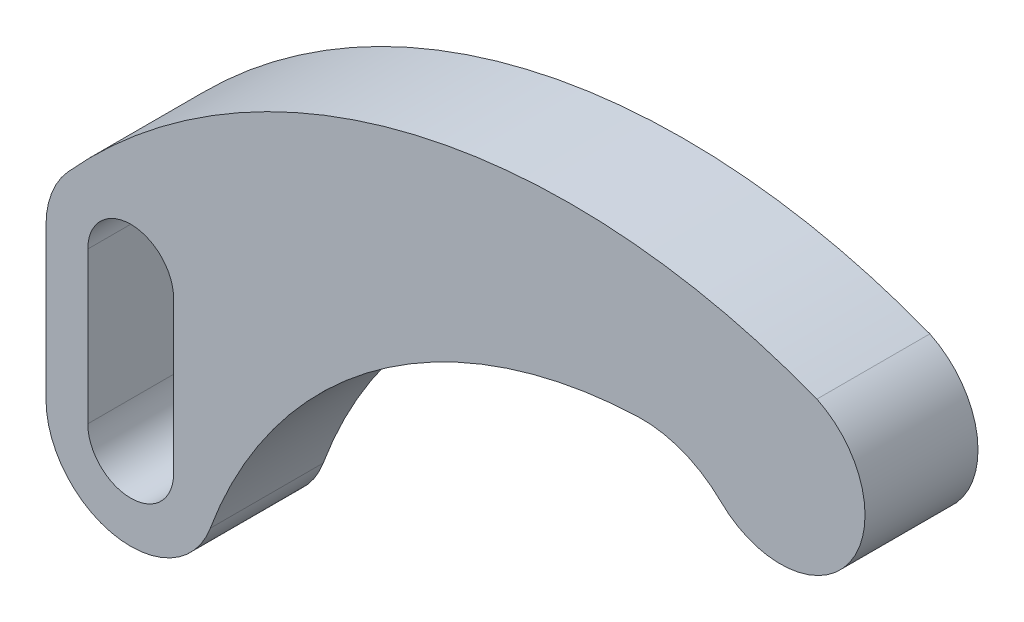
ISO-10303-21;
HEADER;
FILE_DESCRIPTION(('STEP AP214'),'2;1');
FILE_NAME('part.step','',(''),(''),'','','');
FILE_SCHEMA(('AUTOMOTIVE_DESIGN { 1 0 10303 214 1 1 1 1 }'));
ENDSEC;
DATA;
#1=APPLICATION_CONTEXT('core data for automotive mechanical design processes');
#2=APPLICATION_PROTOCOL_DEFINITION('international standard','automotive_design',2000,#1);
#3=PRODUCT_CONTEXT('',#1,'mechanical');
#4=PRODUCT('Part','Part','',(#3));
#5=PRODUCT_RELATED_PRODUCT_CATEGORY('part','',(#4));
#6=PRODUCT_DEFINITION_FORMATION('','',#4);
#7=PRODUCT_DEFINITION_CONTEXT('part definition',#1,'design');
#8=PRODUCT_DEFINITION('design','',#6,#7);
#9=PRODUCT_DEFINITION_SHAPE('','',#8);
#10=(LENGTH_UNIT() NAMED_UNIT(*) SI_UNIT(.MILLI.,.METRE.));
#11=(NAMED_UNIT(*) PLANE_ANGLE_UNIT() SI_UNIT($,.RADIAN.));
#12=(NAMED_UNIT(*) SI_UNIT($,.STERADIAN.) SOLID_ANGLE_UNIT());
#13=UNCERTAINTY_MEASURE_WITH_UNIT(LENGTH_MEASURE(1.E-05),#10,'distance_accuracy_value','');
#14=(GEOMETRIC_REPRESENTATION_CONTEXT(3) GLOBAL_UNCERTAINTY_ASSIGNED_CONTEXT((#13)) GLOBAL_UNIT_ASSIGNED_CONTEXT((#10,
#11,#12)) REPRESENTATION_CONTEXT('',''));
#15=CARTESIAN_POINT('',(0.,0.,0.));
#16=DIRECTION('',(0.,0.,1.));
#17=DIRECTION('',(1.,0.,0.));
#18=AXIS2_PLACEMENT_3D('',#15,#16,#17);
#19=CARTESIAN_POINT('',(-138.292145666748,-40.4654224943898,25.4));
#20=DIRECTION('',(0.,0.,-1.));
#21=DIRECTION('',(-1.,0.,0.));
#22=AXIS2_PLACEMENT_3D('',#19,#20,#21);
#23=CYLINDRICAL_SURFACE('',#22,9.65200000000001);
#24=CARTESIAN_POINT('',(-138.292145666748,-40.4654224943898,0.));
#25=DIRECTION('',(0.,0.,1.));
#26=DIRECTION('',(1.,0.,0.));
#27=AXIS2_PLACEMENT_3D('',#24,#25,#26);
#28=CIRCLE('',#27,9.65200000000001);
#29=CARTESIAN_POINT('',(-147.944145666748,-40.4654224943898,0.));
#30=VERTEX_POINT('',#29);
#31=CARTESIAN_POINT('',(-128.640145666748,-40.4654224943898,0.));
#32=VERTEX_POINT('',#31);
#33=EDGE_CURVE('E184',#30,#32,#28,.T.);
#34=ORIENTED_EDGE('',*,*,#33,.F.);
#35=DIRECTION('',(0.,0.,-1.));
#36=VECTOR('',#35,1.);
#37=CARTESIAN_POINT('',(-147.944145666748,-40.4654224943898,25.4));
#38=LINE('',#37,#36);
#39=CARTESIAN_POINT('',(-147.944145666748,-40.4654224943898,25.4));
#40=VERTEX_POINT('',#39);
#41=EDGE_CURVE('E11',#40,#30,#38,.T.);
#42=ORIENTED_EDGE('',*,*,#41,.F.);
#43=CARTESIAN_POINT('',(-138.292145666748,-40.4654224943898,25.4));
#44=DIRECTION('',(0.,0.,1.));
#45=DIRECTION('',(1.,0.,0.));
#46=AXIS2_PLACEMENT_3D('',#43,#44,#45);
#47=CIRCLE('',#46,9.65200000000001);
#48=CARTESIAN_POINT('',(-128.640145666748,-40.4654224943898,25.4));
#49=VERTEX_POINT('',#48);
#50=EDGE_CURVE('E147',#40,#49,#47,.T.);
#51=ORIENTED_EDGE('',*,*,#50,.T.);
#52=DIRECTION('',(0.,0.,-1.));
#53=VECTOR('',#52,1.);
#54=CARTESIAN_POINT('',(-128.640145666748,-40.4654224943898,25.4));
#55=LINE('',#54,#53);
#56=EDGE_CURVE('E102',#49,#32,#55,.T.);
#57=ORIENTED_EDGE('',*,*,#56,.T.);
#58=EDGE_LOOP('',(#34,#42,#51,#57));
#59=FACE_BOUND('',#58,.T.);
#60=ADVANCED_FACE('F39',(#59),#23,.F.);
#61=CARTESIAN_POINT('',(-147.944145666748,0.,25.4));
#62=DIRECTION('',(1.,0.,0.));
#63=DIRECTION('',(0.,0.,-1.));
#64=AXIS2_PLACEMENT_3D('',#61,#62,#63);
#65=PLANE('',#64);
#66=DIRECTION('',(0.,-1.,0.));
#67=VECTOR('',#66,1.);
#68=CARTESIAN_POINT('',(-147.944145666748,0.,0.));
#69=LINE('',#68,#67);
#70=CARTESIAN_POINT('',(-147.944145666748,-6.42942249438982,0.));
#71=VERTEX_POINT('',#70);
#72=EDGE_CURVE('E138',#71,#30,#69,.T.);
#73=ORIENTED_EDGE('',*,*,#72,.F.);
#74=DIRECTION('',(0.,0.,-1.));
#75=VECTOR('',#74,1.);
#76=CARTESIAN_POINT('',(-147.944145666748,-6.42942249438982,25.4));
#77=LINE('',#76,#75);
#78=CARTESIAN_POINT('',(-147.944145666748,-6.42942249438982,25.4));
#79=VERTEX_POINT('',#78);
#80=EDGE_CURVE('E50',#79,#71,#77,.T.);
#81=ORIENTED_EDGE('',*,*,#80,.F.);
#82=DIRECTION('',(0.,-1.,0.));
#83=VECTOR('',#82,1.);
#84=CARTESIAN_POINT('',(-147.944145666748,0.,25.4));
#85=LINE('',#84,#83);
#86=EDGE_CURVE('E136',#79,#40,#85,.T.);
#87=ORIENTED_EDGE('',*,*,#86,.T.);
#88=ORIENTED_EDGE('',*,*,#41,.T.);
#89=EDGE_LOOP('',(#73,#81,#87,#88));
#90=FACE_BOUND('',#89,.T.);
#91=ADVANCED_FACE('F135',(#90),#65,.T.);
#92=CARTESIAN_POINT('',(-138.292145666748,-6.42942249438982,25.4));
#93=DIRECTION('',(0.,0.,-1.));
#94=DIRECTION('',(-1.,0.,0.));
#95=AXIS2_PLACEMENT_3D('',#92,#93,#94);
#96=CYLINDRICAL_SURFACE('',#95,9.65200000000001);
#97=CARTESIAN_POINT('',(-138.292145666748,-6.42942249438982,0.));
#98=DIRECTION('',(0.,0.,1.));
#99=DIRECTION('',(1.,0.,0.));
#100=AXIS2_PLACEMENT_3D('',#97,#98,#99);
#101=CIRCLE('',#100,9.65200000000001);
#102=CARTESIAN_POINT('',(-128.640145666748,-6.42942249438982,0.));
#103=VERTEX_POINT('',#102);
#104=EDGE_CURVE('E190',#103,#71,#101,.T.);
#105=ORIENTED_EDGE('',*,*,#104,.F.);
#106=DIRECTION('',(0.,0.,-1.));
#107=VECTOR('',#106,1.);
#108=CARTESIAN_POINT('',(-128.640145666748,-6.42942249438982,25.4));
#109=LINE('',#108,#107);
#110=CARTESIAN_POINT('',(-128.640145666748,-6.42942249438982,25.4));
#111=VERTEX_POINT('',#110);
#112=EDGE_CURVE('E95',#111,#103,#109,.T.);
#113=ORIENTED_EDGE('',*,*,#112,.F.);
#114=CARTESIAN_POINT('',(-138.292145666748,-6.42942249438982,25.4));
#115=DIRECTION('',(0.,0.,1.));
#116=DIRECTION('',(1.,0.,0.));
#117=AXIS2_PLACEMENT_3D('',#114,#115,#116);
#118=CIRCLE('',#117,9.65200000000001);
#119=EDGE_CURVE('E146',#111,#79,#118,.T.);
#120=ORIENTED_EDGE('',*,*,#119,.T.);
#121=ORIENTED_EDGE('',*,*,#80,.T.);
#122=EDGE_LOOP('',(#105,#113,#120,#121));
#123=FACE_BOUND('',#122,.T.);
#124=ADVANCED_FACE('F150',(#123),#96,.F.);
#125=CARTESIAN_POINT('',(-20.2813273562544,-83.8414488417584,25.4));
#126=DIRECTION('',(0.,0.,-1.));
#127=DIRECTION('',(-1.,0.,0.));
#128=AXIS2_PLACEMENT_3D('',#125,#126,#127);
#129=CYLINDRICAL_SURFACE('',#128,106.68);
#130=CARTESIAN_POINT('',(-20.2813273562544,-83.8414488417584,0.));
#131=DIRECTION('',(0.,0.,1.));
#132=DIRECTION('',(1.,0.,0.));
#133=AXIS2_PLACEMENT_3D('',#130,#131,#132);
#134=CIRCLE('',#133,106.68);
#135=CARTESIAN_POINT('',(-24.3098335387946,22.7624607391629,0.));
#136=VERTEX_POINT('',#135);
#137=CARTESIAN_POINT('',(-120.411718650007,-47.0375476985366,0.));
#138=VERTEX_POINT('',#137);
#139=EDGE_CURVE('E158',#136,#138,#134,.T.);
#140=ORIENTED_EDGE('',*,*,#139,.F.);
#141=DIRECTION('',(0.,0.,-1.));
#142=VECTOR('',#141,1.);
#143=CARTESIAN_POINT('',(-24.3098335387946,22.7624607391629,25.4));
#144=LINE('',#143,#142);
#145=CARTESIAN_POINT('',(-24.3098335387946,22.7624607391629,25.4));
#146=VERTEX_POINT('',#145);
#147=EDGE_CURVE('E43',#146,#136,#144,.T.);
#148=ORIENTED_EDGE('',*,*,#147,.F.);
#149=CARTESIAN_POINT('',(-20.2813273562544,-83.8414488417584,25.4));
#150=DIRECTION('',(0.,0.,1.));
#151=DIRECTION('',(1.,0.,0.));
#152=AXIS2_PLACEMENT_3D('',#149,#150,#151);
#153=CIRCLE('',#152,106.68);
#154=CARTESIAN_POINT('',(-120.411718650007,-47.0375476985366,25.4));
#155=VERTEX_POINT('',#154);
#156=EDGE_CURVE('E196',#146,#155,#153,.T.);
#157=ORIENTED_EDGE('',*,*,#156,.T.);
#158=DIRECTION('',(0.,0.,-1.));
#159=VECTOR('',#158,1.);
#160=CARTESIAN_POINT('',(-120.411718650007,-47.0375476985366,25.4));
#161=LINE('',#160,#159);
#162=EDGE_CURVE('E154',#155,#138,#161,.T.);
#163=ORIENTED_EDGE('',*,*,#162,.T.);
#164=EDGE_LOOP('',(#140,#148,#157,#163));
#165=FACE_BOUND('',#164,.T.);
#166=ADVANCED_FACE('F41',(#165),#129,.F.);
#167=CARTESIAN_POINT('',(-23.3506654000946,-2.61942249438982,25.4));
#168=DIRECTION('',(0.,0.,-1.));
#169=DIRECTION('',(-1.,0.,0.));
#170=AXIS2_PLACEMENT_3D('',#167,#168,#169);
#171=CYLINDRICAL_SURFACE('',#170,25.4);
#172=CARTESIAN_POINT('',(-23.3506654000946,-2.61942249438982,0.));
#173=DIRECTION('',(0.,0.,1.));
#174=DIRECTION('',(1.,0.,0.));
#175=AXIS2_PLACEMENT_3D('',#172,#173,#174);
#176=CIRCLE('',#175,25.4);
#177=CARTESIAN_POINT('',(-5.57436840961095,15.5234346484673,0.));
#178=VERTEX_POINT('',#177);
#179=EDGE_CURVE('E162',#178,#136,#176,.T.);
#180=ORIENTED_EDGE('',*,*,#179,.F.);
#181=DIRECTION('',(0.,0.,-1.));
#182=VECTOR('',#181,1.);
#183=CARTESIAN_POINT('',(-5.57436840961095,15.5234346484673,25.4));
#184=LINE('',#183,#182);
#185=CARTESIAN_POINT('',(-5.57436840961095,15.5234346484673,25.4));
#186=VERTEX_POINT('',#185);
#187=EDGE_CURVE('E216',#186,#178,#184,.T.);
#188=ORIENTED_EDGE('',*,*,#187,.F.);
#189=CARTESIAN_POINT('',(-23.3506654000946,-2.61942249438982,25.4));
#190=DIRECTION('',(0.,0.,1.));
#191=DIRECTION('',(1.,0.,0.));
#192=AXIS2_PLACEMENT_3D('',#189,#190,#191);
#193=CIRCLE('',#192,25.4);
#194=EDGE_CURVE('E227',#186,#146,#193,.T.);
#195=ORIENTED_EDGE('',*,*,#194,.T.);
#196=ORIENTED_EDGE('',*,*,#147,.T.);
#197=EDGE_LOOP('',(#180,#188,#195,#196));
#198=FACE_BOUND('',#197,.T.);
#199=ADVANCED_FACE('F225',(#198),#171,.F.);
#200=CARTESIAN_POINT('',(7.75785433325176,29.1305775056102,25.4));
#201=DIRECTION('',(0.,0.,-1.));
#202=DIRECTION('',(-1.,0.,0.));
#203=AXIS2_PLACEMENT_3D('',#200,#201,#202);
#204=CYLINDRICAL_SURFACE('',#203,19.05);
#205=CARTESIAN_POINT('',(7.75785433325176,29.1305775056102,0.));
#206=DIRECTION('',(0.,0.,1.));
#207=DIRECTION('',(1.,0.,0.));
#208=AXIS2_PLACEMENT_3D('',#205,#206,#207);
#209=CIRCLE('',#208,19.05);
#210=CARTESIAN_POINT('',(15.981707982364,46.3140210242412,0.));
#211=VERTEX_POINT('',#210);
#212=EDGE_CURVE('E166',#178,#211,#209,.T.);
#213=ORIENTED_EDGE('',*,*,#212,.T.);
#214=DIRECTION('',(0.,0.,-1.));
#215=VECTOR('',#214,1.);
#216=CARTESIAN_POINT('',(15.981707982364,46.3140210242412,25.4));
#217=LINE('',#216,#215);
#218=CARTESIAN_POINT('',(15.981707982364,46.3140210242412,25.4));
#219=VERTEX_POINT('',#218);
#220=EDGE_CURVE('E213',#219,#211,#217,.T.);
#221=ORIENTED_EDGE('',*,*,#220,.F.);
#222=CARTESIAN_POINT('',(7.75785433325176,29.1305775056102,25.4));
#223=DIRECTION('',(0.,0.,1.));
#224=DIRECTION('',(1.,0.,0.));
#225=AXIS2_PLACEMENT_3D('',#222,#223,#224);
#226=CIRCLE('',#225,19.05);
#227=EDGE_CURVE('E246',#186,#219,#226,.T.);
#228=ORIENTED_EDGE('',*,*,#227,.F.);
#229=ORIENTED_EDGE('',*,*,#187,.T.);
#230=EDGE_LOOP('',(#213,#221,#228,#229));
#231=FACE_BOUND('',#230,.T.);
#232=ADVANCED_FACE('F236',(#231),#204,.T.);
#233=CARTESIAN_POINT('',(-39.2533981981608,-95.7241535811308,25.4));
#234=DIRECTION('',(0.,0.,-1.));
#235=DIRECTION('',(-1.,0.,0.));
#236=AXIS2_PLACEMENT_3D('',#233,#234,#235);
#237=CYLINDRICAL_SURFACE('',#236,152.4);
#238=CARTESIAN_POINT('',(-39.2533981981608,-95.7241535811308,0.));
#239=DIRECTION('',(0.,0.,1.));
#240=DIRECTION('',(1.,0.,0.));
#241=AXIS2_PLACEMENT_3D('',#238,#239,#240);
#242=CIRCLE('',#241,152.4);
#243=CARTESIAN_POINT('',(-152.440538162261,6.32696766085889,0.));
#244=VERTEX_POINT('',#243);
#245=EDGE_CURVE('E169',#211,#244,#242,.T.);
#246=ORIENTED_EDGE('',*,*,#245,.T.);
#247=DIRECTION('',(0.,0.,-1.));
#248=VECTOR('',#247,1.);
#249=CARTESIAN_POINT('',(-152.440538162261,6.32696766085889,25.4));
#250=LINE('',#249,#248);
#251=CARTESIAN_POINT('',(-152.440538162261,6.32696766085889,25.4));
#252=VERTEX_POINT('',#251);
#253=EDGE_CURVE('E209',#252,#244,#250,.T.);
#254=ORIENTED_EDGE('',*,*,#253,.F.);
#255=CARTESIAN_POINT('',(-39.2533981981608,-95.7241535811308,25.4));
#256=DIRECTION('',(0.,0.,1.));
#257=DIRECTION('',(1.,0.,0.));
#258=AXIS2_PLACEMENT_3D('',#255,#256,#257);
#259=CIRCLE('',#258,152.4);
#260=EDGE_CURVE('E241',#219,#252,#259,.T.);
#261=ORIENTED_EDGE('',*,*,#260,.F.);
#262=ORIENTED_EDGE('',*,*,#220,.T.);
#263=EDGE_LOOP('',(#246,#254,#261,#262));
#264=FACE_BOUND('',#263,.T.);
#265=ADVANCED_FACE('F239',(#264),#237,.T.);
#266=CARTESIAN_POINT('',(-138.292145666748,-6.42942249438982,25.4));
#267=DIRECTION('',(0.,0.,-1.));
#268=DIRECTION('',(-1.,0.,0.));
#269=AXIS2_PLACEMENT_3D('',#266,#267,#268);
#270=CYLINDRICAL_SURFACE('',#269,19.05);
#271=CARTESIAN_POINT('',(-138.292145666748,-6.42942249438982,0.));
#272=DIRECTION('',(0.,0.,1.));
#273=DIRECTION('',(1.,0.,0.));
#274=AXIS2_PLACEMENT_3D('',#271,#272,#273);
#275=CIRCLE('',#274,19.05);
#276=CARTESIAN_POINT('',(-157.342145666748,-6.42942249438982,0.));
#277=VERTEX_POINT('',#276);
#278=EDGE_CURVE('E172',#244,#277,#275,.T.);
#279=ORIENTED_EDGE('',*,*,#278,.T.);
#280=DIRECTION('',(0.,0.,-1.));
#281=VECTOR('',#280,1.);
#282=CARTESIAN_POINT('',(-157.342145666748,-6.42942249438982,25.4));
#283=LINE('',#282,#281);
#284=CARTESIAN_POINT('',(-157.342145666748,-6.42942249438982,25.4));
#285=VERTEX_POINT('',#284);
#286=EDGE_CURVE('E206',#285,#277,#283,.T.);
#287=ORIENTED_EDGE('',*,*,#286,.F.);
#288=CARTESIAN_POINT('',(-138.292145666748,-6.42942249438982,25.4));
#289=DIRECTION('',(0.,0.,1.));
#290=DIRECTION('',(1.,0.,0.));
#291=AXIS2_PLACEMENT_3D('',#288,#289,#290);
#292=CIRCLE('',#291,19.05);
#293=EDGE_CURVE('E245',#252,#285,#292,.T.);
#294=ORIENTED_EDGE('',*,*,#293,.F.);
#295=ORIENTED_EDGE('',*,*,#253,.T.);
#296=EDGE_LOOP('',(#279,#287,#294,#295));
#297=FACE_BOUND('',#296,.T.);
#298=ADVANCED_FACE('F284',(#297),#270,.T.);
#299=CARTESIAN_POINT('',(-157.342145666748,-2.56617805945395E-13,25.4));
#300=DIRECTION('',(-1.,0.,0.));
#301=DIRECTION('',(0.,-1.,0.));
#302=AXIS2_PLACEMENT_3D('',#299,#300,#301);
#303=PLANE('',#302);
#304=DIRECTION('',(0.,1.,0.));
#305=VECTOR('',#304,1.);
#306=CARTESIAN_POINT('',(-157.342145666748,-2.56617805945395E-13,0.));
#307=LINE('',#306,#305);
#308=CARTESIAN_POINT('',(-157.342145666748,-40.4654224943898,0.));
#309=VERTEX_POINT('',#308);
#310=EDGE_CURVE('E176',#309,#277,#307,.T.);
#311=ORIENTED_EDGE('',*,*,#310,.F.);
#312=DIRECTION('',(0.,0.,-1.));
#313=VECTOR('',#312,1.);
#314=CARTESIAN_POINT('',(-157.342145666748,-40.4654224943898,25.4));
#315=LINE('',#314,#313);
#316=CARTESIAN_POINT('',(-157.342145666748,-40.4654224943898,25.4));
#317=VERTEX_POINT('',#316);
#318=EDGE_CURVE('E203',#317,#309,#315,.T.);
#319=ORIENTED_EDGE('',*,*,#318,.F.);
#320=DIRECTION('',(0.,1.,0.));
#321=VECTOR('',#320,1.);
#322=CARTESIAN_POINT('',(-157.342145666748,-2.56617805945395E-13,25.4));
#323=LINE('',#322,#321);
#324=EDGE_CURVE('E250',#317,#285,#323,.T.);
#325=ORIENTED_EDGE('',*,*,#324,.T.);
#326=ORIENTED_EDGE('',*,*,#286,.T.);
#327=EDGE_LOOP('',(#311,#319,#325,#326));
#328=FACE_BOUND('',#327,.T.);
#329=ADVANCED_FACE('F270',(#328),#303,.T.);
#330=CARTESIAN_POINT('',(-138.292145666748,-40.4654224943898,25.4));
#331=DIRECTION('',(0.,0.,-1.));
#332=DIRECTION('',(-1.,0.,0.));
#333=AXIS2_PLACEMENT_3D('',#330,#331,#332);
#334=CYLINDRICAL_SURFACE('',#333,19.05);
#335=CARTESIAN_POINT('',(-138.292145666748,-40.4654224943898,0.));
#336=DIRECTION('',(0.,0.,1.));
#337=DIRECTION('',(1.,0.,0.));
#338=AXIS2_PLACEMENT_3D('',#335,#336,#337);
#339=CIRCLE('',#338,19.05);
#340=EDGE_CURVE('E180',#309,#138,#339,.T.);
#341=ORIENTED_EDGE('',*,*,#340,.T.);
#342=ORIENTED_EDGE('',*,*,#162,.F.);
#343=CARTESIAN_POINT('',(-138.292145666748,-40.4654224943898,25.4));
#344=DIRECTION('',(0.,0.,1.));
#345=DIRECTION('',(1.,0.,0.));
#346=AXIS2_PLACEMENT_3D('',#343,#344,#345);
#347=CIRCLE('',#346,19.05);
#348=EDGE_CURVE('E258',#317,#155,#347,.T.);
#349=ORIENTED_EDGE('',*,*,#348,.F.);
#350=ORIENTED_EDGE('',*,*,#318,.T.);
#351=EDGE_LOOP('',(#341,#342,#349,#350));
#352=FACE_BOUND('',#351,.T.);
#353=ADVANCED_FACE('F263',(#352),#334,.T.);
#354=CARTESIAN_POINT('',(-128.640145666748,0.,25.4));
#355=DIRECTION('',(1.,0.,0.));
#356=DIRECTION('',(0.,0.,-1.));
#357=AXIS2_PLACEMENT_3D('',#354,#355,#356);
#358=PLANE('',#357);
#359=DIRECTION('',(0.,-1.,0.));
#360=VECTOR('',#359,1.);
#361=CARTESIAN_POINT('',(-128.640145666748,0.,0.));
#362=LINE('',#361,#360);
#363=EDGE_CURVE('E193',#103,#32,#362,.T.);
#364=ORIENTED_EDGE('',*,*,#363,.T.);
#365=ORIENTED_EDGE('',*,*,#56,.F.);
#366=DIRECTION('',(0.,-1.,0.));
#367=VECTOR('',#366,1.);
#368=CARTESIAN_POINT('',(-128.640145666748,0.,25.4));
#369=LINE('',#368,#367);
#370=EDGE_CURVE('E59',#111,#49,#369,.T.);
#371=ORIENTED_EDGE('',*,*,#370,.F.);
#372=ORIENTED_EDGE('',*,*,#112,.T.);
#373=EDGE_LOOP('',(#364,#365,#371,#372));
#374=FACE_BOUND('',#373,.T.);
#375=ADVANCED_FACE('F261',(#374),#358,.F.);
#376=CARTESIAN_POINT('',(0.,0.,25.4));
#377=DIRECTION('',(0.,0.,1.));
#378=DIRECTION('',(1.,0.,0.));
#379=AXIS2_PLACEMENT_3D('',#376,#377,#378);
#380=PLANE('',#379);
#381=ORIENTED_EDGE('',*,*,#156,.F.);
#382=ORIENTED_EDGE('',*,*,#194,.F.);
#383=ORIENTED_EDGE('',*,*,#227,.T.);
#384=ORIENTED_EDGE('',*,*,#260,.T.);
#385=ORIENTED_EDGE('',*,*,#293,.T.);
#386=ORIENTED_EDGE('',*,*,#324,.F.);
#387=ORIENTED_EDGE('',*,*,#348,.T.);
#388=EDGE_LOOP('',(#381,#382,#383,#384,#385,#386,#387));
#389=FACE_BOUND('',#388,.T.);
#390=ORIENTED_EDGE('',*,*,#50,.F.);
#391=ORIENTED_EDGE('',*,*,#86,.F.);
#392=ORIENTED_EDGE('',*,*,#119,.F.);
#393=ORIENTED_EDGE('',*,*,#370,.T.);
#394=EDGE_LOOP('',(#390,#391,#392,#393));
#395=FACE_BOUND('',#394,.T.);
#396=ADVANCED_FACE('F145',(#389,#395),#380,.T.);
#397=CARTESIAN_POINT('',(0.,0.,0.));
#398=DIRECTION('',(0.,0.,1.));
#399=DIRECTION('',(1.,0.,0.));
#400=AXIS2_PLACEMENT_3D('',#397,#398,#399);
#401=PLANE('',#400);
#402=ORIENTED_EDGE('',*,*,#139,.T.);
#403=ORIENTED_EDGE('',*,*,#340,.F.);
#404=ORIENTED_EDGE('',*,*,#310,.T.);
#405=ORIENTED_EDGE('',*,*,#278,.F.);
#406=ORIENTED_EDGE('',*,*,#245,.F.);
#407=ORIENTED_EDGE('',*,*,#212,.F.);
#408=ORIENTED_EDGE('',*,*,#179,.T.);
#409=EDGE_LOOP('',(#402,#403,#404,#405,#406,#407,#408));
#410=FACE_BOUND('',#409,.T.);
#411=ORIENTED_EDGE('',*,*,#33,.T.);
#412=ORIENTED_EDGE('',*,*,#363,.F.);
#413=ORIENTED_EDGE('',*,*,#104,.T.);
#414=ORIENTED_EDGE('',*,*,#72,.T.);
#415=EDGE_LOOP('',(#411,#412,#413,#414));
#416=FACE_BOUND('',#415,.T.);
#417=ADVANCED_FACE('F231',(#410,#416),#401,.F.);
#418=CLOSED_SHELL('',(#60,#91,#124,#166,#199,#232,#265,#298,#329,#353,#375,#396,#417));
#419=MANIFOLD_SOLID_BREP('B2',#418);
#420=ADVANCED_BREP_SHAPE_REPRESENTATION('',(#18,#419),#14);
#421=SHAPE_DEFINITION_REPRESENTATION(#9,#420);
ENDSEC;
END-ISO-10303-21;
